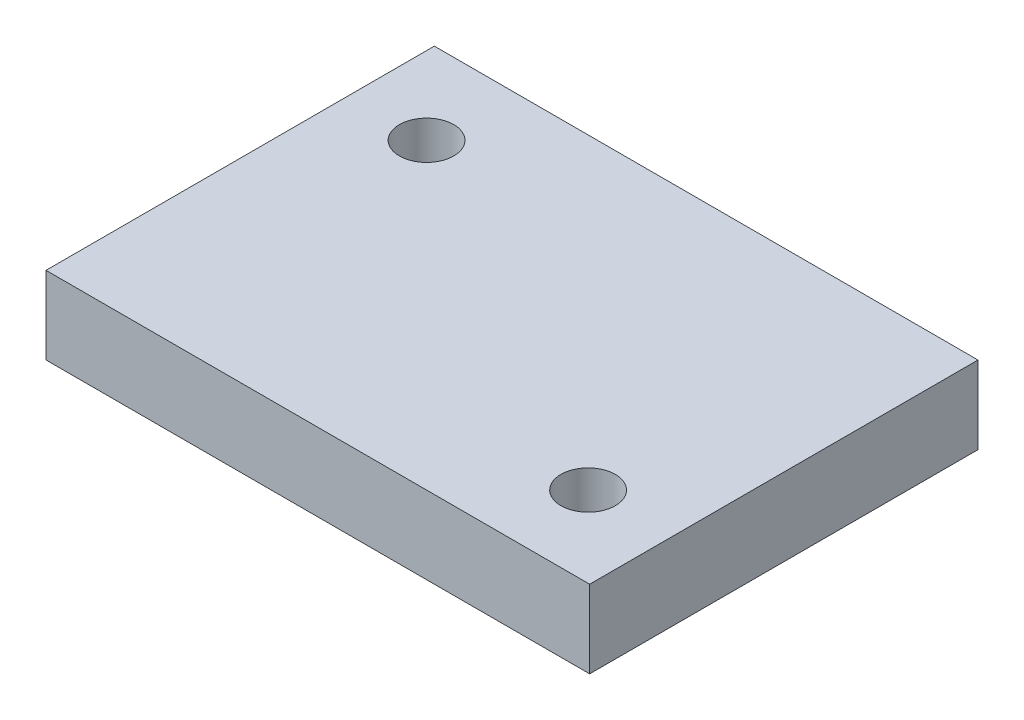
ISO-10303-21;
HEADER;
FILE_DESCRIPTION(('STEP AP214'),'2;1');
FILE_NAME('part.step','',(''),(''),'','','');
FILE_SCHEMA(('AUTOMOTIVE_DESIGN { 1 0 10303 214 1 1 1 1 }'));
ENDSEC;
DATA;
#1=APPLICATION_CONTEXT('core data for automotive mechanical design processes');
#2=APPLICATION_PROTOCOL_DEFINITION('international standard','automotive_design',2000,#1);
#3=PRODUCT_CONTEXT('',#1,'mechanical');
#4=PRODUCT('Part','Part','',(#3));
#5=PRODUCT_RELATED_PRODUCT_CATEGORY('part','',(#4));
#6=PRODUCT_DEFINITION_FORMATION('','',#4);
#7=PRODUCT_DEFINITION_CONTEXT('part definition',#1,'design');
#8=PRODUCT_DEFINITION('design','',#6,#7);
#9=PRODUCT_DEFINITION_SHAPE('','',#8);
#10=(LENGTH_UNIT() NAMED_UNIT(*) SI_UNIT(.MILLI.,.METRE.));
#11=(NAMED_UNIT(*) PLANE_ANGLE_UNIT() SI_UNIT($,.RADIAN.));
#12=(NAMED_UNIT(*) SI_UNIT($,.STERADIAN.) SOLID_ANGLE_UNIT());
#13=UNCERTAINTY_MEASURE_WITH_UNIT(LENGTH_MEASURE(1.E-05),#10,'distance_accuracy_value','');
#14=(GEOMETRIC_REPRESENTATION_CONTEXT(3) GLOBAL_UNCERTAINTY_ASSIGNED_CONTEXT((#13)) GLOBAL_UNIT_ASSIGNED_CONTEXT((#10,
#11,#12)) REPRESENTATION_CONTEXT('',''));
#15=CARTESIAN_POINT('',(0.,0.,0.));
#16=DIRECTION('',(0.,0.,1.));
#17=DIRECTION('',(1.,0.,0.));
#18=AXIS2_PLACEMENT_3D('',#15,#16,#17);
#19=CARTESIAN_POINT('',(0.,10.,0.));
#20=DIRECTION('',(0.,1.,0.));
#21=DIRECTION('',(0.,0.,1.));
#22=AXIS2_PLACEMENT_3D('',#19,#20,#21);
#23=PLANE('',#22);
#24=CARTESIAN_POINT('',(24.4,10.,14.6));
#25=DIRECTION('',(0.,1.,0.));
#26=DIRECTION('',(0.,0.,1.));
#27=AXIS2_PLACEMENT_3D('',#24,#25,#26);
#28=CIRCLE('',#27,3.5);
#29=CARTESIAN_POINT('',(24.4,10.,18.1));
#30=VERTEX_POINT('',#29);
#31=EDGE_CURVE('E85',#30,#30,#28,.F.);
#32=ORIENTED_EDGE('',*,*,#31,.T.);
#33=EDGE_LOOP('',(#32));
#34=FACE_BOUND('',#33,.T.);
#35=CARTESIAN_POINT('',(-25.,10.,-14.));
#36=DIRECTION('',(0.,1.,0.));
#37=DIRECTION('',(0.,0.,1.));
#38=AXIS2_PLACEMENT_3D('',#35,#36,#37);
#39=CIRCLE('',#38,3.5);
#40=CARTESIAN_POINT('',(-25.,10.,-10.5));
#41=VERTEX_POINT('',#40);
#42=EDGE_CURVE('E20',#41,#41,#39,.F.);
#43=ORIENTED_EDGE('',*,*,#42,.T.);
#44=EDGE_LOOP('',(#43));
#45=FACE_BOUND('',#44,.T.);
#46=DIRECTION('',(-1.,0.,0.));
#47=VECTOR('',#46,1.);
#48=CARTESIAN_POINT('',(35.,10.,-25.));
#49=LINE('',#48,#47);
#50=CARTESIAN_POINT('',(-35.,10.,-25.));
#51=VERTEX_POINT('',#50);
#52=CARTESIAN_POINT('',(35.,10.,-25.));
#53=VERTEX_POINT('',#52);
#54=EDGE_CURVE('E71',#51,#53,#49,.F.);
#55=ORIENTED_EDGE('',*,*,#54,.F.);
#56=DIRECTION('',(0.,0.,1.));
#57=VECTOR('',#56,1.);
#58=CARTESIAN_POINT('',(-35.,10.,-25.));
#59=LINE('',#58,#57);
#60=CARTESIAN_POINT('',(-35.,10.,25.));
#61=VERTEX_POINT('',#60);
#62=EDGE_CURVE('E68',#61,#51,#59,.F.);
#63=ORIENTED_EDGE('',*,*,#62,.F.);
#64=DIRECTION('',(1.,0.,0.));
#65=VECTOR('',#64,1.);
#66=CARTESIAN_POINT('',(-35.,10.,25.));
#67=LINE('',#66,#65);
#68=CARTESIAN_POINT('',(35.,10.,25.));
#69=VERTEX_POINT('',#68);
#70=EDGE_CURVE('E59',#69,#61,#67,.F.);
#71=ORIENTED_EDGE('',*,*,#70,.F.);
#72=DIRECTION('',(0.,0.,-1.));
#73=VECTOR('',#72,1.);
#74=CARTESIAN_POINT('',(35.,10.,25.));
#75=LINE('',#74,#73);
#76=EDGE_CURVE('E54',#53,#69,#75,.F.);
#77=ORIENTED_EDGE('',*,*,#76,.F.);
#78=EDGE_LOOP('',(#55,#63,#71,#77));
#79=FACE_BOUND('',#78,.T.);
#80=ADVANCED_FACE('F17',(#34,#45,#79),#23,.T.);
#81=CARTESIAN_POINT('',(-35.,0.,-25.));
#82=DIRECTION('',(-1.,0.,0.));
#83=DIRECTION('',(0.,0.,1.));
#84=AXIS2_PLACEMENT_3D('',#81,#82,#83);
#85=PLANE('',#84);
#86=DIRECTION('',(0.,1.,0.));
#87=VECTOR('',#86,1.);
#88=CARTESIAN_POINT('',(-35.,0.,-25.));
#89=LINE('',#88,#87);
#90=CARTESIAN_POINT('',(-35.,0.,-25.));
#91=VERTEX_POINT('',#90);
#92=EDGE_CURVE('E95',#91,#51,#89,.T.);
#93=ORIENTED_EDGE('',*,*,#92,.F.);
#94=DIRECTION('',(0.,0.,1.));
#95=VECTOR('',#94,1.);
#96=CARTESIAN_POINT('',(-35.,0.,0.));
#97=LINE('',#96,#95);
#98=CARTESIAN_POINT('',(-35.,0.,25.));
#99=VERTEX_POINT('',#98);
#100=EDGE_CURVE('E78',#91,#99,#97,.T.);
#101=ORIENTED_EDGE('',*,*,#100,.T.);
#102=DIRECTION('',(0.,1.,0.));
#103=VECTOR('',#102,1.);
#104=CARTESIAN_POINT('',(-35.,0.,25.));
#105=LINE('',#104,#103);
#106=EDGE_CURVE('E64',#61,#99,#105,.F.);
#107=ORIENTED_EDGE('',*,*,#106,.F.);
#108=ORIENTED_EDGE('',*,*,#62,.T.);
#109=EDGE_LOOP('',(#93,#101,#107,#108));
#110=FACE_BOUND('',#109,.T.);
#111=ADVANCED_FACE('F77',(#110),#85,.T.);
#112=CARTESIAN_POINT('',(-35.,0.,25.));
#113=DIRECTION('',(0.,0.,1.));
#114=DIRECTION('',(1.,0.,0.));
#115=AXIS2_PLACEMENT_3D('',#112,#113,#114);
#116=PLANE('',#115);
#117=ORIENTED_EDGE('',*,*,#106,.T.);
#118=DIRECTION('',(1.,0.,0.));
#119=VECTOR('',#118,1.);
#120=CARTESIAN_POINT('',(0.,0.,25.));
#121=LINE('',#120,#119);
#122=CARTESIAN_POINT('',(35.,0.,25.));
#123=VERTEX_POINT('',#122);
#124=EDGE_CURVE('E89',#99,#123,#121,.T.);
#125=ORIENTED_EDGE('',*,*,#124,.T.);
#126=DIRECTION('',(0.,1.,0.));
#127=VECTOR('',#126,1.);
#128=CARTESIAN_POINT('',(35.,0.,25.));
#129=LINE('',#128,#127);
#130=EDGE_CURVE('E66',#69,#123,#129,.F.);
#131=ORIENTED_EDGE('',*,*,#130,.F.);
#132=ORIENTED_EDGE('',*,*,#70,.T.);
#133=EDGE_LOOP('',(#117,#125,#131,#132));
#134=FACE_BOUND('',#133,.T.);
#135=ADVANCED_FACE('F61',(#134),#116,.T.);
#136=CARTESIAN_POINT('',(35.,0.,25.));
#137=DIRECTION('',(1.,0.,0.));
#138=DIRECTION('',(0.,0.,-1.));
#139=AXIS2_PLACEMENT_3D('',#136,#137,#138);
#140=PLANE('',#139);
#141=ORIENTED_EDGE('',*,*,#130,.T.);
#142=DIRECTION('',(0.,0.,1.));
#143=VECTOR('',#142,1.);
#144=CARTESIAN_POINT('',(35.,0.,0.));
#145=LINE('',#144,#143);
#146=CARTESIAN_POINT('',(35.,0.,-25.));
#147=VERTEX_POINT('',#146);
#148=EDGE_CURVE('E102',#123,#147,#145,.F.);
#149=ORIENTED_EDGE('',*,*,#148,.T.);
#150=DIRECTION('',(0.,1.,0.));
#151=VECTOR('',#150,1.);
#152=CARTESIAN_POINT('',(35.,0.,-25.));
#153=LINE('',#152,#151);
#154=EDGE_CURVE('E35',#53,#147,#153,.F.);
#155=ORIENTED_EDGE('',*,*,#154,.F.);
#156=ORIENTED_EDGE('',*,*,#76,.T.);
#157=EDGE_LOOP('',(#141,#149,#155,#156));
#158=FACE_BOUND('',#157,.T.);
#159=ADVANCED_FACE('F101',(#158),#140,.T.);
#160=CARTESIAN_POINT('',(35.,0.,-25.));
#161=DIRECTION('',(0.,0.,-1.));
#162=DIRECTION('',(-1.,0.,0.));
#163=AXIS2_PLACEMENT_3D('',#160,#161,#162);
#164=PLANE('',#163);
#165=ORIENTED_EDGE('',*,*,#154,.T.);
#166=DIRECTION('',(1.,0.,0.));
#167=VECTOR('',#166,1.);
#168=CARTESIAN_POINT('',(0.,0.,-25.));
#169=LINE('',#168,#167);
#170=EDGE_CURVE('E84',#147,#91,#169,.F.);
#171=ORIENTED_EDGE('',*,*,#170,.T.);
#172=ORIENTED_EDGE('',*,*,#92,.T.);
#173=ORIENTED_EDGE('',*,*,#54,.T.);
#174=EDGE_LOOP('',(#165,#171,#172,#173));
#175=FACE_BOUND('',#174,.T.);
#176=ADVANCED_FACE('F107',(#175),#164,.T.);
#177=CARTESIAN_POINT('',(-25.,0.,-14.));
#178=DIRECTION('',(0.,1.,0.));
#179=DIRECTION('',(0.,0.,1.));
#180=AXIS2_PLACEMENT_3D('',#177,#178,#179);
#181=CYLINDRICAL_SURFACE('',#180,3.5);
#182=ORIENTED_EDGE('',*,*,#42,.F.);
#183=EDGE_LOOP('',(#182));
#184=FACE_BOUND('',#183,.T.);
#185=CARTESIAN_POINT('',(-25.,0.,-14.));
#186=DIRECTION('',(0.,1.,0.));
#187=DIRECTION('',(0.,0.,1.));
#188=AXIS2_PLACEMENT_3D('',#185,#186,#187);
#189=CIRCLE('',#188,3.5);
#190=CARTESIAN_POINT('',(-25.,0.,-10.5));
#191=VERTEX_POINT('',#190);
#192=EDGE_CURVE('E26',#191,#191,#189,.F.);
#193=ORIENTED_EDGE('',*,*,#192,.T.);
#194=EDGE_LOOP('',(#193));
#195=FACE_BOUND('',#194,.T.);
#196=ADVANCED_FACE('F109',(#184,#195),#181,.F.);
#197=CARTESIAN_POINT('',(24.4,0.,14.6));
#198=DIRECTION('',(0.,1.,0.));
#199=DIRECTION('',(0.,0.,1.));
#200=AXIS2_PLACEMENT_3D('',#197,#198,#199);
#201=CYLINDRICAL_SURFACE('',#200,3.5);
#202=ORIENTED_EDGE('',*,*,#31,.F.);
#203=EDGE_LOOP('',(#202));
#204=FACE_BOUND('',#203,.T.);
#205=CARTESIAN_POINT('',(24.4,0.,14.6));
#206=DIRECTION('',(0.,1.,0.));
#207=DIRECTION('',(0.,0.,1.));
#208=AXIS2_PLACEMENT_3D('',#205,#206,#207);
#209=CIRCLE('',#208,3.5);
#210=CARTESIAN_POINT('',(24.4,0.,18.1));
#211=VERTEX_POINT('',#210);
#212=EDGE_CURVE('E11',#211,#211,#209,.F.);
#213=ORIENTED_EDGE('',*,*,#212,.T.);
#214=EDGE_LOOP('',(#213));
#215=FACE_BOUND('',#214,.T.);
#216=ADVANCED_FACE('F116',(#204,#215),#201,.F.);
#217=CARTESIAN_POINT('',(0.,0.,0.));
#218=DIRECTION('',(0.,1.,0.));
#219=DIRECTION('',(0.,0.,1.));
#220=AXIS2_PLACEMENT_3D('',#217,#218,#219);
#221=PLANE('',#220);
#222=ORIENTED_EDGE('',*,*,#212,.F.);
#223=EDGE_LOOP('',(#222));
#224=FACE_BOUND('',#223,.T.);
#225=ORIENTED_EDGE('',*,*,#192,.F.);
#226=EDGE_LOOP('',(#225));
#227=FACE_BOUND('',#226,.T.);
#228=ORIENTED_EDGE('',*,*,#148,.F.);
#229=ORIENTED_EDGE('',*,*,#124,.F.);
#230=ORIENTED_EDGE('',*,*,#100,.F.);
#231=ORIENTED_EDGE('',*,*,#170,.F.);
#232=EDGE_LOOP('',(#228,#229,#230,#231));
#233=FACE_BOUND('',#232,.T.);
#234=ADVANCED_FACE('F104',(#224,#227,#233),#221,.F.);
#235=CLOSED_SHELL('',(#80,#111,#135,#159,#176,#196,#216,#234));
#236=MANIFOLD_SOLID_BREP('B1',#235);
#237=ADVANCED_BREP_SHAPE_REPRESENTATION('',(#18,#236),#14);
#238=SHAPE_DEFINITION_REPRESENTATION(#9,#237);
ENDSEC;
END-ISO-10303-21;
